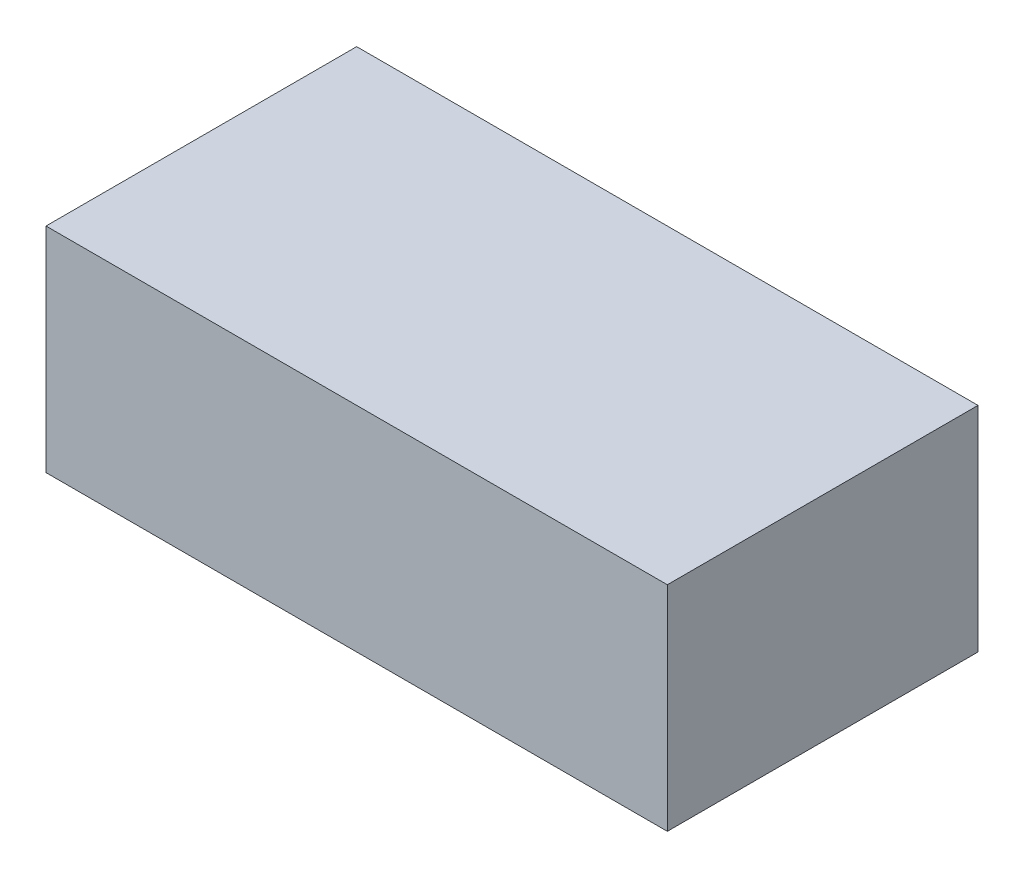
ISO-10303-21;
HEADER;
FILE_DESCRIPTION(('STEP AP214'),'2;1');
FILE_NAME('part.step','',(''),(''),'','','');
FILE_SCHEMA(('AUTOMOTIVE_DESIGN { 1 0 10303 214 1 1 1 1 }'));
ENDSEC;
DATA;
#1=APPLICATION_CONTEXT('core data for automotive mechanical design processes');
#2=APPLICATION_PROTOCOL_DEFINITION('international standard','automotive_design',2000,#1);
#3=PRODUCT_CONTEXT('',#1,'mechanical');
#4=PRODUCT('Part','Part','',(#3));
#5=PRODUCT_RELATED_PRODUCT_CATEGORY('part','',(#4));
#6=PRODUCT_DEFINITION_FORMATION('','',#4);
#7=PRODUCT_DEFINITION_CONTEXT('part definition',#1,'design');
#8=PRODUCT_DEFINITION('design','',#6,#7);
#9=PRODUCT_DEFINITION_SHAPE('','',#8);
#10=(LENGTH_UNIT() NAMED_UNIT(*) SI_UNIT(.MILLI.,.METRE.));
#11=(NAMED_UNIT(*) PLANE_ANGLE_UNIT() SI_UNIT($,.RADIAN.));
#12=(NAMED_UNIT(*) SI_UNIT($,.STERADIAN.) SOLID_ANGLE_UNIT());
#13=UNCERTAINTY_MEASURE_WITH_UNIT(LENGTH_MEASURE(1.E-05),#10,'distance_accuracy_value','');
#14=(GEOMETRIC_REPRESENTATION_CONTEXT(3) GLOBAL_UNCERTAINTY_ASSIGNED_CONTEXT((#13)) GLOBAL_UNIT_ASSIGNED_CONTEXT((#10,
#11,#12)) REPRESENTATION_CONTEXT('',''));
#15=CARTESIAN_POINT('',(0.,0.,0.));
#16=DIRECTION('',(0.,0.,1.));
#17=DIRECTION('',(1.,0.,0.));
#18=AXIS2_PLACEMENT_3D('',#15,#16,#17);
#19=CARTESIAN_POINT('',(0.8,0.55,-0.4));
#20=DIRECTION('',(-1.,0.,0.));
#21=DIRECTION('',(0.,0.,1.));
#22=AXIS2_PLACEMENT_3D('',#19,#20,#21);
#23=PLANE('',#22);
#24=DIRECTION('',(0.,0.,-1.));
#25=VECTOR('',#24,1.);
#26=CARTESIAN_POINT('',(0.8,0.,-0.4));
#27=LINE('',#26,#25);
#28=CARTESIAN_POINT('',(0.8,0.,0.4));
#29=VERTEX_POINT('',#28);
#30=CARTESIAN_POINT('',(0.8,0.,-0.4));
#31=VERTEX_POINT('',#30);
#32=EDGE_CURVE('E97',#29,#31,#27,.T.);
#33=ORIENTED_EDGE('',*,*,#32,.T.);
#34=DIRECTION('',(0.,-1.,0.));
#35=VECTOR('',#34,1.);
#36=CARTESIAN_POINT('',(0.8,0.55,-0.4));
#37=LINE('',#36,#35);
#38=CARTESIAN_POINT('',(0.8,0.55,-0.4));
#39=VERTEX_POINT('',#38);
#40=EDGE_CURVE('E11',#39,#31,#37,.T.);
#41=ORIENTED_EDGE('',*,*,#40,.F.);
#42=DIRECTION('',(0.,0.,-1.));
#43=VECTOR('',#42,1.);
#44=CARTESIAN_POINT('',(0.8,0.55,-0.4));
#45=LINE('',#44,#43);
#46=CARTESIAN_POINT('',(0.8,0.55,0.4));
#47=VERTEX_POINT('',#46);
#48=EDGE_CURVE('E85',#47,#39,#45,.T.);
#49=ORIENTED_EDGE('',*,*,#48,.F.);
#50=DIRECTION('',(0.,-1.,0.));
#51=VECTOR('',#50,1.);
#52=CARTESIAN_POINT('',(0.8,0.55,0.4));
#53=LINE('',#52,#51);
#54=EDGE_CURVE('E93',#47,#29,#53,.T.);
#55=ORIENTED_EDGE('',*,*,#54,.T.);
#56=EDGE_LOOP('',(#33,#41,#49,#55));
#57=FACE_BOUND('',#56,.T.);
#58=ADVANCED_FACE('F34',(#57),#23,.F.);
#59=CARTESIAN_POINT('',(-0.8,0.55,-0.4));
#60=DIRECTION('',(0.,0.,1.));
#61=DIRECTION('',(1.,0.,0.));
#62=AXIS2_PLACEMENT_3D('',#59,#60,#61);
#63=PLANE('',#62);
#64=DIRECTION('',(-1.,0.,0.));
#65=VECTOR('',#64,1.);
#66=CARTESIAN_POINT('',(-0.8,0.,-0.4));
#67=LINE('',#66,#65);
#68=CARTESIAN_POINT('',(-0.8,0.,-0.4));
#69=VERTEX_POINT('',#68);
#70=EDGE_CURVE('E89',#31,#69,#67,.T.);
#71=ORIENTED_EDGE('',*,*,#70,.T.);
#72=DIRECTION('',(0.,-1.,0.));
#73=VECTOR('',#72,1.);
#74=CARTESIAN_POINT('',(-0.8,0.55,-0.4));
#75=LINE('',#74,#73);
#76=CARTESIAN_POINT('',(-0.8,0.55,-0.4));
#77=VERTEX_POINT('',#76);
#78=EDGE_CURVE('E42',#77,#69,#75,.T.);
#79=ORIENTED_EDGE('',*,*,#78,.F.);
#80=DIRECTION('',(-1.,0.,0.));
#81=VECTOR('',#80,1.);
#82=CARTESIAN_POINT('',(-0.8,0.55,-0.4));
#83=LINE('',#82,#81);
#84=EDGE_CURVE('E80',#39,#77,#83,.T.);
#85=ORIENTED_EDGE('',*,*,#84,.F.);
#86=ORIENTED_EDGE('',*,*,#40,.T.);
#87=EDGE_LOOP('',(#71,#79,#85,#86));
#88=FACE_BOUND('',#87,.T.);
#89=ADVANCED_FACE('F88',(#88),#63,.F.);
#90=CARTESIAN_POINT('',(-0.8,0.55,-0.4));
#91=DIRECTION('',(1.,0.,0.));
#92=DIRECTION('',(0.,0.,-1.));
#93=AXIS2_PLACEMENT_3D('',#90,#91,#92);
#94=PLANE('',#93);
#95=DIRECTION('',(0.,0.,1.));
#96=VECTOR('',#95,1.);
#97=CARTESIAN_POINT('',(-0.8,0.,-0.4));
#98=LINE('',#97,#96);
#99=CARTESIAN_POINT('',(-0.8,0.,0.4));
#100=VERTEX_POINT('',#99);
#101=EDGE_CURVE('E67',#69,#100,#98,.T.);
#102=ORIENTED_EDGE('',*,*,#101,.T.);
#103=DIRECTION('',(0.,-1.,0.));
#104=VECTOR('',#103,1.);
#105=CARTESIAN_POINT('',(-0.8,0.55,0.4));
#106=LINE('',#105,#104);
#107=CARTESIAN_POINT('',(-0.8,0.55,0.4));
#108=VERTEX_POINT('',#107);
#109=EDGE_CURVE('E90',#108,#100,#106,.T.);
#110=ORIENTED_EDGE('',*,*,#109,.F.);
#111=DIRECTION('',(0.,0.,1.));
#112=VECTOR('',#111,1.);
#113=CARTESIAN_POINT('',(-0.8,0.55,-0.4));
#114=LINE('',#113,#112);
#115=EDGE_CURVE('E83',#77,#108,#114,.T.);
#116=ORIENTED_EDGE('',*,*,#115,.F.);
#117=ORIENTED_EDGE('',*,*,#78,.T.);
#118=EDGE_LOOP('',(#102,#110,#116,#117));
#119=FACE_BOUND('',#118,.T.);
#120=ADVANCED_FACE('F91',(#119),#94,.F.);
#121=CARTESIAN_POINT('',(-0.8,0.55,0.4));
#122=DIRECTION('',(0.,0.,-1.));
#123=DIRECTION('',(-1.,0.,0.));
#124=AXIS2_PLACEMENT_3D('',#121,#122,#123);
#125=PLANE('',#124);
#126=DIRECTION('',(1.,0.,0.));
#127=VECTOR('',#126,1.);
#128=CARTESIAN_POINT('',(-0.8,0.,0.4));
#129=LINE('',#128,#127);
#130=EDGE_CURVE('E73',#100,#29,#129,.T.);
#131=ORIENTED_EDGE('',*,*,#130,.T.);
#132=ORIENTED_EDGE('',*,*,#54,.F.);
#133=DIRECTION('',(1.,0.,0.));
#134=VECTOR('',#133,1.);
#135=CARTESIAN_POINT('',(-0.8,0.55,0.4));
#136=LINE('',#135,#134);
#137=EDGE_CURVE('E50',#108,#47,#136,.T.);
#138=ORIENTED_EDGE('',*,*,#137,.F.);
#139=ORIENTED_EDGE('',*,*,#109,.T.);
#140=EDGE_LOOP('',(#131,#132,#138,#139));
#141=FACE_BOUND('',#140,.T.);
#142=ADVANCED_FACE('F104',(#141),#125,.F.);
#143=CARTESIAN_POINT('',(0.,0.55,0.));
#144=DIRECTION('',(0.,1.,0.));
#145=DIRECTION('',(0.,0.,1.));
#146=AXIS2_PLACEMENT_3D('',#143,#144,#145);
#147=PLANE('',#146);
#148=ORIENTED_EDGE('',*,*,#48,.T.);
#149=ORIENTED_EDGE('',*,*,#84,.T.);
#150=ORIENTED_EDGE('',*,*,#115,.T.);
#151=ORIENTED_EDGE('',*,*,#137,.T.);
#152=EDGE_LOOP('',(#148,#149,#150,#151));
#153=FACE_BOUND('',#152,.T.);
#154=ADVANCED_FACE('F81',(#153),#147,.T.);
#155=CARTESIAN_POINT('',(0.,0.,0.));
#156=DIRECTION('',(0.,1.,0.));
#157=DIRECTION('',(0.,0.,1.));
#158=AXIS2_PLACEMENT_3D('',#155,#156,#157);
#159=PLANE('',#158);
#160=ORIENTED_EDGE('',*,*,#32,.F.);
#161=ORIENTED_EDGE('',*,*,#130,.F.);
#162=ORIENTED_EDGE('',*,*,#101,.F.);
#163=ORIENTED_EDGE('',*,*,#70,.F.);
#164=EDGE_LOOP('',(#160,#161,#162,#163));
#165=FACE_BOUND('',#164,.T.);
#166=ADVANCED_FACE('F107',(#165),#159,.F.);
#167=CLOSED_SHELL('',(#58,#89,#120,#142,#154,#166));
#168=MANIFOLD_SOLID_BREP('B2',#167);
#169=ADVANCED_BREP_SHAPE_REPRESENTATION('',(#18,#168),#14);
#170=SHAPE_DEFINITION_REPRESENTATION(#9,#169);
ENDSEC;
END-ISO-10303-21;
